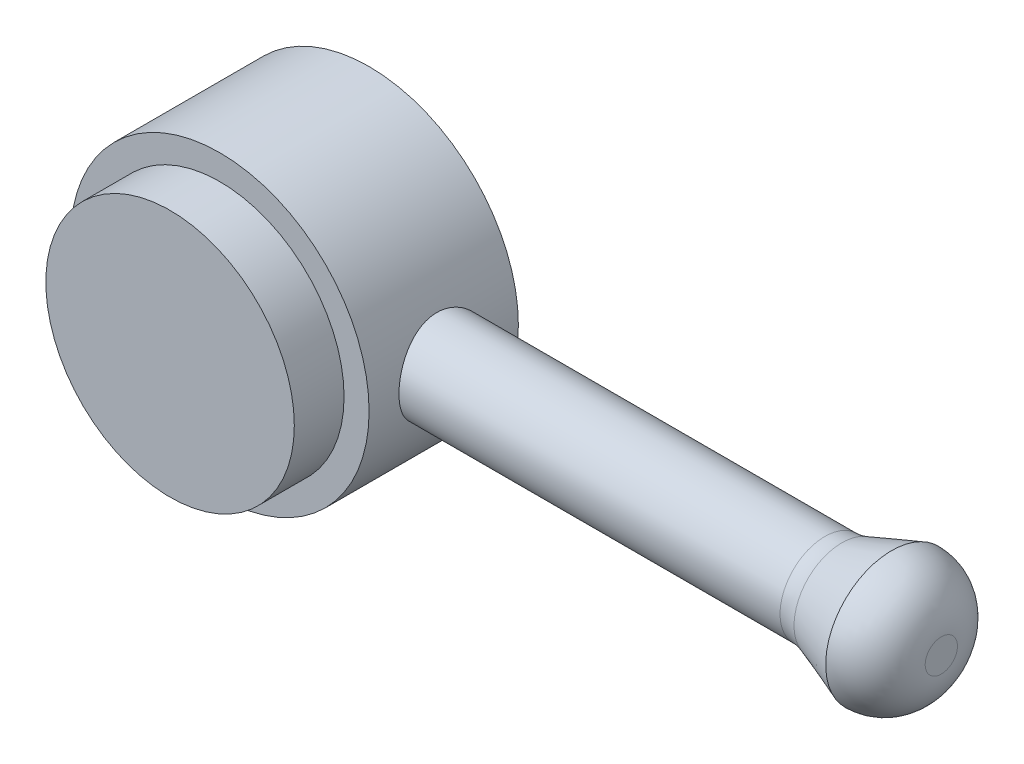
ISO-10303-21;
HEADER;
FILE_DESCRIPTION(('STEP AP214'),'2;1');
FILE_NAME('part.step','',(''),(''),'','','');
FILE_SCHEMA(('AUTOMOTIVE_DESIGN { 1 0 10303 214 1 1 1 1 }'));
ENDSEC;
DATA;
#1=APPLICATION_CONTEXT('core data for automotive mechanical design processes');
#2=APPLICATION_PROTOCOL_DEFINITION('international standard','automotive_design',2000,#1);
#3=PRODUCT_CONTEXT('',#1,'mechanical');
#4=PRODUCT('Part','Part','',(#3));
#5=PRODUCT_RELATED_PRODUCT_CATEGORY('part','',(#4));
#6=PRODUCT_DEFINITION_FORMATION('','',#4);
#7=PRODUCT_DEFINITION_CONTEXT('part definition',#1,'design');
#8=PRODUCT_DEFINITION('design','',#6,#7);
#9=PRODUCT_DEFINITION_SHAPE('','',#8);
#10=(LENGTH_UNIT() NAMED_UNIT(*) SI_UNIT(.MILLI.,.METRE.));
#11=(NAMED_UNIT(*) PLANE_ANGLE_UNIT() SI_UNIT($,.RADIAN.));
#12=(NAMED_UNIT(*) SI_UNIT($,.STERADIAN.) SOLID_ANGLE_UNIT());
#13=UNCERTAINTY_MEASURE_WITH_UNIT(LENGTH_MEASURE(1.E-05),#10,'distance_accuracy_value','');
#14=(GEOMETRIC_REPRESENTATION_CONTEXT(3) GLOBAL_UNCERTAINTY_ASSIGNED_CONTEXT((#13)) GLOBAL_UNIT_ASSIGNED_CONTEXT((#10,
#11,#12)) REPRESENTATION_CONTEXT('',''));
#15=CARTESIAN_POINT('',(0.,0.,0.));
#16=DIRECTION('',(0.,0.,1.));
#17=DIRECTION('',(1.,0.,0.));
#18=AXIS2_PLACEMENT_3D('',#15,#16,#17);
#19=CARTESIAN_POINT('',(0.,0.,20.));
#20=DIRECTION('',(0.,0.,-1.));
#21=DIRECTION('',(-1.,0.,0.));
#22=AXIS2_PLACEMENT_3D('',#19,#20,#21);
#23=CYLINDRICAL_SURFACE('',#22,12.485);
#24=CARTESIAN_POINT('',(0.,0.,0.));
#25=DIRECTION('',(0.,0.,1.));
#26=DIRECTION('',(1.,0.,0.));
#27=AXIS2_PLACEMENT_3D('',#24,#25,#26);
#28=CIRCLE('',#27,12.485);
#29=CARTESIAN_POINT('',(12.485,0.,0.));
#30=VERTEX_POINT('',#29);
#31=EDGE_CURVE('E57',#30,#30,#28,.T.);
#32=ORIENTED_EDGE('',*,*,#31,.T.);
#33=EDGE_LOOP('',(#32));
#34=FACE_BOUND('',#33,.T.);
#35=CARTESIAN_POINT('',(0.,0.,5.));
#36=DIRECTION('',(0.,0.,1.));
#37=DIRECTION('',(1.,0.,0.));
#38=AXIS2_PLACEMENT_3D('',#35,#36,#37);
#39=CIRCLE('',#38,12.485);
#40=CARTESIAN_POINT('',(12.485,0.,5.));
#41=VERTEX_POINT('',#40);
#42=EDGE_CURVE('E119',#41,#41,#39,.T.);
#43=ORIENTED_EDGE('',*,*,#42,.F.);
#44=EDGE_LOOP('',(#43));
#45=FACE_BOUND('',#44,.T.);
#46=ADVANCED_FACE('F39',(#34,#45),#23,.T.);
#47=CARTESIAN_POINT('',(0.,0.,-15.));
#48=DIRECTION('',(0.,0.,1.));
#49=DIRECTION('',(1.,0.,0.));
#50=AXIS2_PLACEMENT_3D('',#47,#48,#49);
#51=CYLINDRICAL_SURFACE('',#50,15.);
#52=CARTESIAN_POINT('',(0.,0.,-15.));
#53=DIRECTION('',(0.,0.,-1.));
#54=DIRECTION('',(-1.,0.,0.));
#55=AXIS2_PLACEMENT_3D('',#52,#53,#54);
#56=CIRCLE('',#55,15.);
#57=CARTESIAN_POINT('',(-15.,0.,-15.));
#58=VERTEX_POINT('',#57);
#59=EDGE_CURVE('E117',#58,#58,#56,.T.);
#60=ORIENTED_EDGE('',*,*,#59,.F.);
#61=EDGE_LOOP('',(#60));
#62=FACE_BOUND('',#61,.T.);
#63=CARTESIAN_POINT('',(0.,0.,0.));
#64=DIRECTION('',(0.,0.,-1.));
#65=DIRECTION('',(-1.,0.,0.));
#66=AXIS2_PLACEMENT_3D('',#63,#64,#65);
#67=CIRCLE('',#66,15.);
#68=CARTESIAN_POINT('',(-15.,0.,0.));
#69=VERTEX_POINT('',#68);
#70=EDGE_CURVE('E111',#69,#69,#67,.T.);
#71=ORIENTED_EDGE('',*,*,#70,.T.);
#72=EDGE_LOOP('',(#71));
#73=FACE_BOUND('',#72,.T.);
#74=CARTESIAN_POINT('',(15.,0.,-12.));
#75=CARTESIAN_POINT('',(14.9999978775165,0.246865838259899,-11.9999970075453));
#76=CARTESIAN_POINT('',(14.9938474708186,0.493761955054588,-11.9796184091281));
#77=CARTESIAN_POINT('',(14.9699131678107,0.980364375914642,-11.8988359373337));
#78=CARTESIAN_POINT('',(14.9521258016908,1.22006851323426,-11.83842012593));
#79=CARTESIAN_POINT('',(14.9068665750551,1.68519812326358,-11.6797619492692));
#80=CARTESIAN_POINT('',(14.8794090075127,1.91064409318612,-11.5815753911432));
#81=CARTESIAN_POINT('',(14.8176632771294,2.34187254315939,-11.3503917208325));
#82=CARTESIAN_POINT('',(14.7833742057621,2.54765240240901,-11.2173899778138));
#83=CARTESIAN_POINT('',(14.7105221157831,2.93961539155123,-10.916327977582));
#84=CARTESIAN_POINT('',(14.6718715097106,3.12515421373301,-10.7474501223422));
#85=CARTESIAN_POINT('',(14.5951750263137,3.46574762769972,-10.3811723102695));
#86=CARTESIAN_POINT('',(14.5571292517368,3.62079708982327,-10.1837675636252));
#87=CARTESIAN_POINT('',(14.4850234198114,3.89940113171118,-9.76058774088706));
#88=CARTESIAN_POINT('',(14.4510721999095,4.02216927066621,-9.5342746170274));
#89=CARTESIAN_POINT('',(14.3923086118276,4.22764184324301,-9.06303223730951));
#90=CARTESIAN_POINT('',(14.3674940494243,4.31035589759993,-8.81810746821754));
#91=CARTESIAN_POINT('',(14.3307261251287,4.43104901047884,-8.3238292016072));
#92=CARTESIAN_POINT('',(14.3184320796465,4.47021588703771,-8.07479176840295));
#93=CARTESIAN_POINT('',(14.3070836925825,4.50641191844278,-7.57340053135493));
#94=CARTESIAN_POINT('',(14.3080261431508,4.5034512828421,-7.32104754584221));
#95=CARTESIAN_POINT('',(14.3227423217119,4.45640931598414,-6.82984827414727));
#96=CARTESIAN_POINT('',(14.3360516567949,4.41381615784306,-6.59084324882755));
#97=CARTESIAN_POINT('',(14.373250685681,4.29112261277515,-6.12354064109807));
#98=CARTESIAN_POINT('',(14.3971414236524,4.2110185242411,-5.89524411785807));
#99=CARTESIAN_POINT('',(14.4531819925707,4.01448079962182,-5.45219895104402));
#100=CARTESIAN_POINT('',(14.4854404835648,3.89756450804233,-5.23767874814125));
#101=CARTESIAN_POINT('',(14.5545296099156,3.63105667765745,-4.83080393396238));
#102=CARTESIAN_POINT('',(14.5913613523862,3.48145722007682,-4.63845471175674));
#103=CARTESIAN_POINT('',(14.6673303389627,3.14643872296726,-4.27294142771594));
#104=CARTESIAN_POINT('',(14.7064996293215,2.95978472240115,-4.10091400791152));
#105=CARTESIAN_POINT('',(14.7813673218912,2.55978977794167,-3.79033804780671));
#106=CARTESIAN_POINT('',(14.8170655055505,2.3464471555826,-3.65179161475657));
#107=CARTESIAN_POINT('',(14.8812948020859,1.89706511502847,-3.41142023260595));
#108=CARTESIAN_POINT('',(14.9097763100499,1.66088324924387,-3.30984745125045));
#109=CARTESIAN_POINT('',(14.9560056549662,1.17373624681054,-3.14820122970107));
#110=CARTESIAN_POINT('',(14.9737564856099,0.922775254768741,-3.08811621440252));
#111=CARTESIAN_POINT('',(14.9960509393063,0.422856728005,-3.01304346630183));
#112=CARTESIAN_POINT('',(15.0010455125337,0.174150292803563,-2.99651524259517));
#113=CARTESIAN_POINT('',(14.9985876972528,-0.32249881747015,-3.00470746713624));
#114=CARTESIAN_POINT('',(14.9911369703327,-0.570441590072342,-3.02942240895432));
#115=CARTESIAN_POINT('',(14.9649209096149,-1.05271081592909,-3.11815383333449));
#116=CARTESIAN_POINT('',(14.9464148939824,-1.28721831784251,-3.18127016274261));
#117=CARTESIAN_POINT('',(14.900230435246,-1.74226391686357,-3.3439296983346));
#118=CARTESIAN_POINT('',(14.8725508896328,-1.96280033107675,-3.44347728311358));
#119=CARTESIAN_POINT('',(14.8100896305395,-2.38931156838316,-3.6787594964434));
#120=CARTESIAN_POINT('',(14.7751584248892,-2.594831478599,-3.81527802284393));
#121=CARTESIAN_POINT('',(14.7022040629306,-2.98056992394045,-4.11967426215841));
#122=CARTESIAN_POINT('',(14.6641801329363,-3.16078209706783,-4.28755983566295));
#123=CARTESIAN_POINT('',(14.5875951560701,-3.49757233653078,-4.65716192510811));
#124=CARTESIAN_POINT('',(14.5490647509827,-3.65305443694502,-4.85988562731548));
#125=CARTESIAN_POINT('',(14.4772954571692,-3.92786985216469,-5.28938381704033));
#126=CARTESIAN_POINT('',(14.4440564296968,-4.04720411488447,-5.51615767367363));
#127=CARTESIAN_POINT('',(14.3870156883946,-4.24552041381474,-5.98659747376506));
#128=CARTESIAN_POINT('',(14.3631701351025,-4.32469040811032,-6.2301785596135));
#129=CARTESIAN_POINT('',(14.3277478310961,-4.44065192445459,-6.72806390679071));
#130=CARTESIAN_POINT('',(14.3161668760408,-4.47745796936773,-6.98236446234911));
#131=CARTESIAN_POINT('',(14.3069991741234,-4.50665953454895,-7.48308455516526));
#132=CARTESIAN_POINT('',(14.3088494205059,-4.5008416592383,-7.72939095314826));
#133=CARTESIAN_POINT('',(14.3249820358828,-4.44922516332915,-8.21734231020184));
#134=CARTESIAN_POINT('',(14.3392639070385,-4.40342814374111,-8.45898745554153));
#135=CARTESIAN_POINT('',(14.3782729108386,-4.27430666413029,-8.92783619739502));
#136=CARTESIAN_POINT('',(14.402868136574,-4.19145526521372,-9.15518186207608));
#137=CARTESIAN_POINT('',(14.459708367079,-3.99094521363221,-9.59292731646217));
#138=CARTESIAN_POINT('',(14.4919548357762,-3.87327989888584,-9.80332385292472));
#139=CARTESIAN_POINT('',(14.5619302928301,-3.60146291415263,-10.2094893495788));
#140=CARTESIAN_POINT('',(14.5998162049287,-3.44613828278994,-10.4044462837806));
#141=CARTESIAN_POINT('',(14.676039613486,-3.10552303889333,-10.7661074949243));
#142=CARTESIAN_POINT('',(14.7143772247131,-2.92022465140347,-10.9328044184035));
#143=CARTESIAN_POINT('',(14.7885280971236,-2.51839728654978,-11.2380702368849));
#144=CARTESIAN_POINT('',(14.8242347929713,-2.30111365737183,-11.3756743405664));
#145=CARTESIAN_POINT('',(14.8878204136733,-1.84542412195058,-11.6122055097121));
#146=CARTESIAN_POINT('',(14.9157029979317,-1.60702815899686,-11.7111506648235));
#147=CARTESIAN_POINT('',(14.9580652490793,-1.14227313796585,-11.8586858269582));
#148=CARTESIAN_POINT('',(14.9736608214321,-0.917360885862705,-11.9115350186497));
#149=CARTESIAN_POINT('',(14.9946283348347,-0.461640585692339,-11.9821905757247));
#150=CARTESIAN_POINT('',(15.0000019846422,-0.230833529574419,-12.0000027981145));
#151=CARTESIAN_POINT('',(15.,0.,-12.));
#152=B_SPLINE_CURVE_WITH_KNOTS('',3,(#74,#75,#76,#77,#78,#79,#80,#81,#82,#83,#84,#85,#86,#87,
#88,#89,#90,#91,#92,#93,#94,#95,#96,#97,#98,#99,#100,#101,#102,#103,#104,#105,#106,#107,#108,
#109,#110,#111,#112,#113,#114,#115,#116,#117,#118,#119,#120,#121,#122,#123,#124,#125,#126,#127,
#128,#129,#130,#131,#132,#133,#134,#135,#136,#137,#138,#139,#140,#141,#142,#143,#144,#145,#146,
#147,#148,#149,#150,#151),.UNSPECIFIED.,.T.,.F.,(4,2,2,2,2,2,2,2,2,2,2,2,2,2,2,2,2,2,2,2,2,2,2,
2,2,2,2,2,2,2,2,2,2,2,2,2,2,2,4),(0.,0.739749610837831,1.479719894538,2.21860102890262,
2.9575804932381,3.71566808844574,4.47388311865899,5.24914443012327,6.02421943629671,
6.77759068069796,7.53077934957268,8.25678050095591,8.98285330978861,9.71887279346216,
10.4550708048052,11.2220131214936,11.9890036959807,12.7611314064992,13.5330436059128,
14.2772642832049,15.0213856065584,15.7487024005184,16.4761066378604,17.2203391711358,
17.9647584600543,18.7362120097331,19.507645327629,20.2754344485861,21.0429602838571,
21.7785046641267,22.5140195900334,23.240401212267,23.9669219267786,24.7199077705833,
25.4730892471105,26.2482898848855,27.0231273480424,27.7149507580992,28.4066585086516),.UNSPECIFIED.);
#153=CARTESIAN_POINT('',(15.,0.,-12.));
#154=VERTEX_POINT('',#153);
#155=EDGE_CURVE('E52',#154,#154,#152,.T.);
#156=ORIENTED_EDGE('',*,*,#155,.F.);
#157=EDGE_LOOP('',(#156));
#158=FACE_BOUND('',#157,.T.);
#159=ADVANCED_FACE('F66',(#62,#73,#158),#51,.T.);
#160=CARTESIAN_POINT('',(0.,0.,-15.));
#161=DIRECTION('',(0.,0.,-1.));
#162=DIRECTION('',(-1.,0.,0.));
#163=AXIS2_PLACEMENT_3D('',#160,#161,#162);
#164=PLANE('',#163);
#165=ORIENTED_EDGE('',*,*,#59,.T.);
#166=EDGE_LOOP('',(#165));
#167=FACE_BOUND('',#166,.T.);
#168=ADVANCED_FACE('F78',(#167),#164,.T.);
#169=CARTESIAN_POINT('',(0.,0.,0.));
#170=DIRECTION('',(0.,0.,-1.));
#171=DIRECTION('',(-1.,0.,0.));
#172=AXIS2_PLACEMENT_3D('',#169,#170,#171);
#173=PLANE('',#172);
#174=ORIENTED_EDGE('',*,*,#31,.F.);
#175=EDGE_LOOP('',(#174));
#176=FACE_BOUND('',#175,.T.);
#177=ORIENTED_EDGE('',*,*,#70,.F.);
#178=EDGE_LOOP('',(#177));
#179=FACE_BOUND('',#178,.T.);
#180=ADVANCED_FACE('F76',(#176,#179),#173,.F.);
#181=CARTESIAN_POINT('',(55.,0.,-7.5));
#182=DIRECTION('',(-1.,0.,0.));
#183=DIRECTION('',(0.,0.,1.));
#184=AXIS2_PLACEMENT_3D('',#181,#182,#183);
#185=CYLINDRICAL_SURFACE('',#184,4.5);
#186=CARTESIAN_POINT('',(53.2941277890768,0.,-7.5));
#187=DIRECTION('',(1.,0.,0.));
#188=DIRECTION('',(0.,0.,-1.));
#189=AXIS2_PLACEMENT_3D('',#186,#187,#188);
#190=CIRCLE('',#189,4.5);
#191=CARTESIAN_POINT('',(53.2941277890768,0.,-12.));
#192=VERTEX_POINT('',#191);
#193=EDGE_CURVE('E10',#192,#192,#190,.F.);
#194=ORIENTED_EDGE('',*,*,#193,.T.);
#195=EDGE_LOOP('',(#194));
#196=FACE_BOUND('',#195,.T.);
#197=ORIENTED_EDGE('',*,*,#155,.T.);
#198=EDGE_LOOP('',(#197));
#199=FACE_BOUND('',#198,.T.);
#200=ADVANCED_FACE('F70',(#196,#199),#185,.T.);
#201=CARTESIAN_POINT('',(55.,0.,-7.5));
#202=DIRECTION('',(1.,0.,0.));
#203=DIRECTION('',(0.,0.,-1.));
#204=AXIS2_PLACEMENT_3D('',#201,#202,#203);
#205=CONICAL_SURFACE('',#204,4.8,0.349065850398866);
#206=CARTESIAN_POINT('',(60.,0.,-7.5));
#207=DIRECTION('',(1.,0.,0.));
#208=DIRECTION('',(0.,0.,-1.));
#209=AXIS2_PLACEMENT_3D('',#206,#207,#208);
#210=CIRCLE('',#209,6.61985117133101);
#211=CARTESIAN_POINT('',(60.,0.,-14.119851171331));
#212=VERTEX_POINT('',#211);
#213=EDGE_CURVE('E108',#212,#212,#210,.T.);
#214=ORIENTED_EDGE('',*,*,#213,.F.);
#215=EDGE_LOOP('',(#214));
#216=FACE_BOUND('',#215,.T.);
#217=CARTESIAN_POINT('',(55.,0.,-7.5));
#218=DIRECTION('',(1.,0.,0.));
#219=DIRECTION('',(0.,0.,-1.));
#220=AXIS2_PLACEMENT_3D('',#217,#218,#219);
#221=CIRCLE('',#220,4.8);
#222=CARTESIAN_POINT('',(55.,0.,-12.3));
#223=VERTEX_POINT('',#222);
#224=EDGE_CURVE('E112',#223,#223,#221,.T.);
#225=ORIENTED_EDGE('',*,*,#224,.T.);
#226=EDGE_LOOP('',(#225));
#227=FACE_BOUND('',#226,.T.);
#228=ADVANCED_FACE('F75',(#216,#227),#205,.T.);
#229=CARTESIAN_POINT('',(65.,0.,-7.5));
#230=DIRECTION('',(1.,0.,0.));
#231=DIRECTION('',(0.,0.,-1.));
#232=AXIS2_PLACEMENT_3D('',#229,#230,#231);
#233=PLANE('',#232);
#234=CARTESIAN_POINT('',(65.,0.,-7.5));
#235=DIRECTION('',(1.,0.,0.));
#236=DIRECTION('',(0.,0.,-1.));
#237=AXIS2_PLACEMENT_3D('',#234,#235,#236);
#238=CIRCLE('',#237,1.61985117133101);
#239=CARTESIAN_POINT('',(65.,0.,-9.11985117133101));
#240=VERTEX_POINT('',#239);
#241=EDGE_CURVE('E47',#240,#240,#238,.T.);
#242=ORIENTED_EDGE('',*,*,#241,.T.);
#243=EDGE_LOOP('',(#242));
#244=FACE_BOUND('',#243,.T.);
#245=ADVANCED_FACE('F97',(#244),#233,.T.);
#246=CARTESIAN_POINT('',(60.,0.,-7.5));
#247=DIRECTION('',(1.,0.,0.));
#248=DIRECTION('',(0.,0.,-1.));
#249=AXIS2_PLACEMENT_3D('',#246,#247,#248);
#250=DEGENERATE_TOROIDAL_SURFACE('',#249,1.61985117133101,5.,.T.);
#251=ORIENTED_EDGE('',*,*,#213,.T.);
#252=EDGE_LOOP('',(#251));
#253=FACE_BOUND('',#252,.T.);
#254=ORIENTED_EDGE('',*,*,#241,.F.);
#255=EDGE_LOOP('',(#254));
#256=FACE_BOUND('',#255,.T.);
#257=ADVANCED_FACE('F95',(#253,#256),#250,.T.);
#258=CARTESIAN_POINT('',(53.2941277890768,0.,-7.5));
#259=DIRECTION('',(1.,0.,0.));
#260=DIRECTION('',(0.,0.,-1.));
#261=AXIS2_PLACEMENT_3D('',#258,#259,#260);
#262=TOROIDAL_SURFACE('',#261,9.5,5.);
#263=ORIENTED_EDGE('',*,*,#193,.F.);
#264=EDGE_LOOP('',(#263));
#265=FACE_BOUND('',#264,.T.);
#266=ORIENTED_EDGE('',*,*,#224,.F.);
#267=EDGE_LOOP('',(#266));
#268=FACE_BOUND('',#267,.T.);
#269=ADVANCED_FACE('F41',(#265,#268),#262,.F.);
#270=CARTESIAN_POINT('',(0.,0.,5.));
#271=DIRECTION('',(0.,0.,1.));
#272=DIRECTION('',(1.,0.,0.));
#273=AXIS2_PLACEMENT_3D('',#270,#271,#272);
#274=PLANE('',#273);
#275=ORIENTED_EDGE('',*,*,#42,.T.);
#276=EDGE_LOOP('',(#275));
#277=FACE_BOUND('',#276,.T.);
#278=ADVANCED_FACE('F103',(#277),#274,.T.);
#279=CLOSED_SHELL('',(#46,#159,#168,#180,#200,#228,#245,#257,#269,#278));
#280=MANIFOLD_SOLID_BREP('B2',#279);
#281=ADVANCED_BREP_SHAPE_REPRESENTATION('',(#18,#280),#14);
#282=SHAPE_DEFINITION_REPRESENTATION(#9,#281);
ENDSEC;
END-ISO-10303-21;
